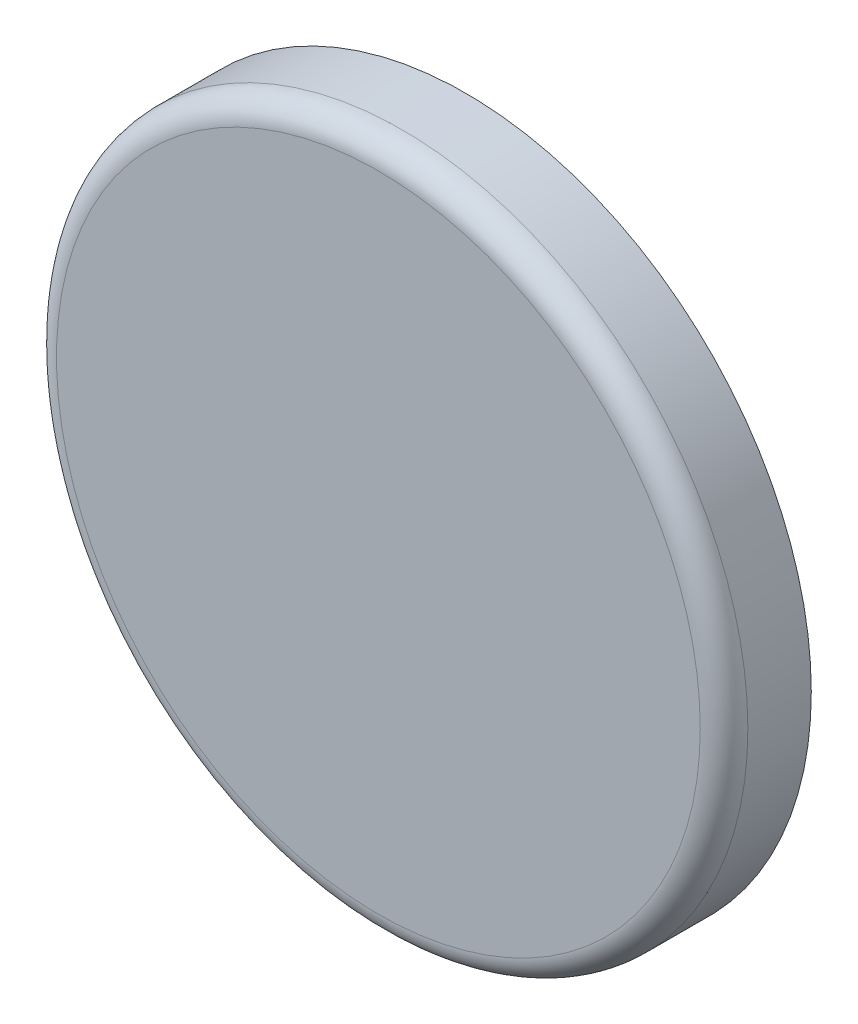
ISO-10303-21;
HEADER;
FILE_DESCRIPTION(('STEP AP214'),'2;1');
FILE_NAME('part.step','',(''),(''),'','','');
FILE_SCHEMA(('AUTOMOTIVE_DESIGN { 1 0 10303 214 1 1 1 1 }'));
ENDSEC;
DATA;
#1=APPLICATION_CONTEXT('core data for automotive mechanical design processes');
#2=APPLICATION_PROTOCOL_DEFINITION('international standard','automotive_design',2000,#1);
#3=PRODUCT_CONTEXT('',#1,'mechanical');
#4=PRODUCT('Part','Part','',(#3));
#5=PRODUCT_RELATED_PRODUCT_CATEGORY('part','',(#4));
#6=PRODUCT_DEFINITION_FORMATION('','',#4);
#7=PRODUCT_DEFINITION_CONTEXT('part definition',#1,'design');
#8=PRODUCT_DEFINITION('design','',#6,#7);
#9=PRODUCT_DEFINITION_SHAPE('','',#8);
#10=(LENGTH_UNIT() NAMED_UNIT(*) SI_UNIT(.MILLI.,.METRE.));
#11=(NAMED_UNIT(*) PLANE_ANGLE_UNIT() SI_UNIT($,.RADIAN.));
#12=(NAMED_UNIT(*) SI_UNIT($,.STERADIAN.) SOLID_ANGLE_UNIT());
#13=UNCERTAINTY_MEASURE_WITH_UNIT(LENGTH_MEASURE(1.E-05),#10,'distance_accuracy_value','');
#14=(GEOMETRIC_REPRESENTATION_CONTEXT(3) GLOBAL_UNCERTAINTY_ASSIGNED_CONTEXT((#13)) GLOBAL_UNIT_ASSIGNED_CONTEXT((#10,
#11,#12)) REPRESENTATION_CONTEXT('',''));
#15=CARTESIAN_POINT('',(0.,0.,0.));
#16=DIRECTION('',(0.,0.,1.));
#17=DIRECTION('',(1.,0.,0.));
#18=AXIS2_PLACEMENT_3D('',#15,#16,#17);
#19=CARTESIAN_POINT('',(0.,0.,11.));
#20=DIRECTION('',(0.,0.,-1.));
#21=DIRECTION('',(-1.,0.,0.));
#22=AXIS2_PLACEMENT_3D('',#19,#20,#21);
#23=CYLINDRICAL_SURFACE('',#22,43.5901731995853);
#24=CARTESIAN_POINT('',(0.,0.,8.));
#25=DIRECTION('',(0.,0.,1.));
#26=DIRECTION('',(1.,0.,0.));
#27=AXIS2_PLACEMENT_3D('',#24,#25,#26);
#28=CIRCLE('',#27,43.5901731995853);
#29=CARTESIAN_POINT('',(43.5901731995853,0.,8.));
#30=VERTEX_POINT('',#29);
#31=EDGE_CURVE('E10',#30,#30,#28,.F.);
#32=ORIENTED_EDGE('',*,*,#31,.T.);
#33=EDGE_LOOP('',(#32));
#34=FACE_BOUND('',#33,.T.);
#35=CARTESIAN_POINT('',(0.,0.,0.));
#36=DIRECTION('',(0.,0.,1.));
#37=DIRECTION('',(1.,0.,0.));
#38=AXIS2_PLACEMENT_3D('',#35,#36,#37);
#39=CIRCLE('',#38,43.5901731995853);
#40=CARTESIAN_POINT('',(43.5901731995853,0.,0.));
#41=VERTEX_POINT('',#40);
#42=EDGE_CURVE('E42',#41,#41,#39,.T.);
#43=ORIENTED_EDGE('',*,*,#42,.T.);
#44=EDGE_LOOP('',(#43));
#45=FACE_BOUND('',#44,.T.);
#46=ADVANCED_FACE('F30',(#34,#45),#23,.T.);
#47=CARTESIAN_POINT('',(0.,0.,11.));
#48=DIRECTION('',(0.,0.,1.));
#49=DIRECTION('',(1.,0.,0.));
#50=AXIS2_PLACEMENT_3D('',#47,#48,#49);
#51=PLANE('',#50);
#52=CARTESIAN_POINT('',(0.,0.,11.));
#53=DIRECTION('',(0.,0.,1.));
#54=DIRECTION('',(1.,0.,0.));
#55=AXIS2_PLACEMENT_3D('',#52,#53,#54);
#56=CIRCLE('',#55,40.5901731995853);
#57=CARTESIAN_POINT('',(40.5901731995853,0.,11.));
#58=VERTEX_POINT('',#57);
#59=EDGE_CURVE('E38',#58,#58,#56,.T.);
#60=ORIENTED_EDGE('',*,*,#59,.T.);
#61=EDGE_LOOP('',(#60));
#62=FACE_BOUND('',#61,.T.);
#63=ADVANCED_FACE('F76',(#62),#51,.T.);
#64=CARTESIAN_POINT('',(0.,0.,0.));
#65=DIRECTION('',(0.,0.,1.));
#66=DIRECTION('',(1.,0.,0.));
#67=AXIS2_PLACEMENT_3D('',#64,#65,#66);
#68=PLANE('',#67);
#69=CARTESIAN_POINT('',(0.,0.,0.));
#70=DIRECTION('',(0.,0.,-1.));
#71=DIRECTION('',(-1.,0.,0.));
#72=AXIS2_PLACEMENT_3D('',#69,#70,#71);
#73=CIRCLE('',#72,7.);
#74=CARTESIAN_POINT('',(-7.,0.,0.));
#75=VERTEX_POINT('',#74);
#76=EDGE_CURVE('E50',#75,#75,#73,.T.);
#77=ORIENTED_EDGE('',*,*,#76,.F.);
#78=EDGE_LOOP('',(#77));
#79=FACE_BOUND('',#78,.T.);
#80=ORIENTED_EDGE('',*,*,#42,.F.);
#81=EDGE_LOOP('',(#80));
#82=FACE_BOUND('',#81,.T.);
#83=ADVANCED_FACE('F80',(#79,#82),#68,.F.);
#84=CARTESIAN_POINT('',(0.,0.,8.));
#85=DIRECTION('',(0.,0.,1.));
#86=DIRECTION('',(1.,0.,0.));
#87=AXIS2_PLACEMENT_3D('',#84,#85,#86);
#88=TOROIDAL_SURFACE('',#87,40.5901731995853,3.);
#89=ORIENTED_EDGE('',*,*,#31,.F.);
#90=EDGE_LOOP('',(#89));
#91=FACE_BOUND('',#90,.T.);
#92=ORIENTED_EDGE('',*,*,#59,.F.);
#93=EDGE_LOOP('',(#92));
#94=FACE_BOUND('',#93,.T.);
#95=ADVANCED_FACE('F32',(#91,#94),#88,.T.);
#96=CARTESIAN_POINT('',(0.,0.,4.5));
#97=DIRECTION('',(0.,0.,-1.));
#98=DIRECTION('',(-1.,0.,0.));
#99=AXIS2_PLACEMENT_3D('',#96,#97,#98);
#100=PLANE('',#99);
#101=CARTESIAN_POINT('',(0.,0.,4.5));
#102=DIRECTION('',(0.,0.,-1.));
#103=DIRECTION('',(-1.,0.,0.));
#104=AXIS2_PLACEMENT_3D('',#101,#102,#103);
#105=CIRCLE('',#104,7.);
#106=CARTESIAN_POINT('',(-7.,0.,4.5));
#107=VERTEX_POINT('',#106);
#108=EDGE_CURVE('E53',#107,#107,#105,.T.);
#109=ORIENTED_EDGE('',*,*,#108,.T.);
#110=EDGE_LOOP('',(#109));
#111=FACE_BOUND('',#110,.T.);
#112=CARTESIAN_POINT('',(0.,0.,4.5));
#113=DIRECTION('',(0.,0.,-1.));
#114=DIRECTION('',(-1.,0.,0.));
#115=AXIS2_PLACEMENT_3D('',#112,#113,#114);
#116=CIRCLE('',#115,5.875);
#117=CARTESIAN_POINT('',(-5.875,0.,4.5));
#118=VERTEX_POINT('',#117);
#119=EDGE_CURVE('E34',#118,#118,#116,.F.);
#120=ORIENTED_EDGE('',*,*,#119,.T.);
#121=EDGE_LOOP('',(#120));
#122=FACE_BOUND('',#121,.T.);
#123=ADVANCED_FACE('F60',(#111,#122),#100,.T.);
#124=CARTESIAN_POINT('',(0.,0.,4.5));
#125=DIRECTION('',(0.,0.,-1.));
#126=DIRECTION('',(-1.,0.,0.));
#127=AXIS2_PLACEMENT_3D('',#124,#125,#126);
#128=CYLINDRICAL_SURFACE('',#127,7.);
#129=ORIENTED_EDGE('',*,*,#108,.F.);
#130=EDGE_LOOP('',(#129));
#131=FACE_BOUND('',#130,.T.);
#132=ORIENTED_EDGE('',*,*,#76,.T.);
#133=EDGE_LOOP('',(#132));
#134=FACE_BOUND('',#133,.T.);
#135=ADVANCED_FACE('F70',(#131,#134),#128,.F.);
#136=CARTESIAN_POINT('',(0.,0.,9.));
#137=DIRECTION('',(0.,0.,-1.));
#138=DIRECTION('',(-1.,0.,0.));
#139=AXIS2_PLACEMENT_3D('',#136,#137,#138);
#140=PLANE('',#139);
#141=CARTESIAN_POINT('',(0.,0.,9.));
#142=DIRECTION('',(0.,0.,-1.));
#143=DIRECTION('',(-1.,0.,0.));
#144=AXIS2_PLACEMENT_3D('',#141,#142,#143);
#145=CIRCLE('',#144,5.875);
#146=CARTESIAN_POINT('',(-5.875,0.,9.));
#147=VERTEX_POINT('',#146);
#148=EDGE_CURVE('E47',#147,#147,#145,.T.);
#149=ORIENTED_EDGE('',*,*,#148,.T.);
#150=EDGE_LOOP('',(#149));
#151=FACE_BOUND('',#150,.T.);
#152=ADVANCED_FACE('F64',(#151),#140,.T.);
#153=CARTESIAN_POINT('',(0.,0.,9.));
#154=DIRECTION('',(0.,0.,-1.));
#155=DIRECTION('',(-1.,0.,0.));
#156=AXIS2_PLACEMENT_3D('',#153,#154,#155);
#157=CYLINDRICAL_SURFACE('',#156,5.875);
#158=ORIENTED_EDGE('',*,*,#148,.F.);
#159=EDGE_LOOP('',(#158));
#160=FACE_BOUND('',#159,.T.);
#161=ORIENTED_EDGE('',*,*,#119,.F.);
#162=EDGE_LOOP('',(#161));
#163=FACE_BOUND('',#162,.T.);
#164=ADVANCED_FACE('F62',(#160,#163),#157,.F.);
#165=CLOSED_SHELL('',(#46,#63,#83,#95,#123,#135,#152,#164));
#166=MANIFOLD_SOLID_BREP('B2',#165);
#167=ADVANCED_BREP_SHAPE_REPRESENTATION('',(#18,#166),#14);
#168=SHAPE_DEFINITION_REPRESENTATION(#9,#167);
ENDSEC;
END-ISO-10303-21;
